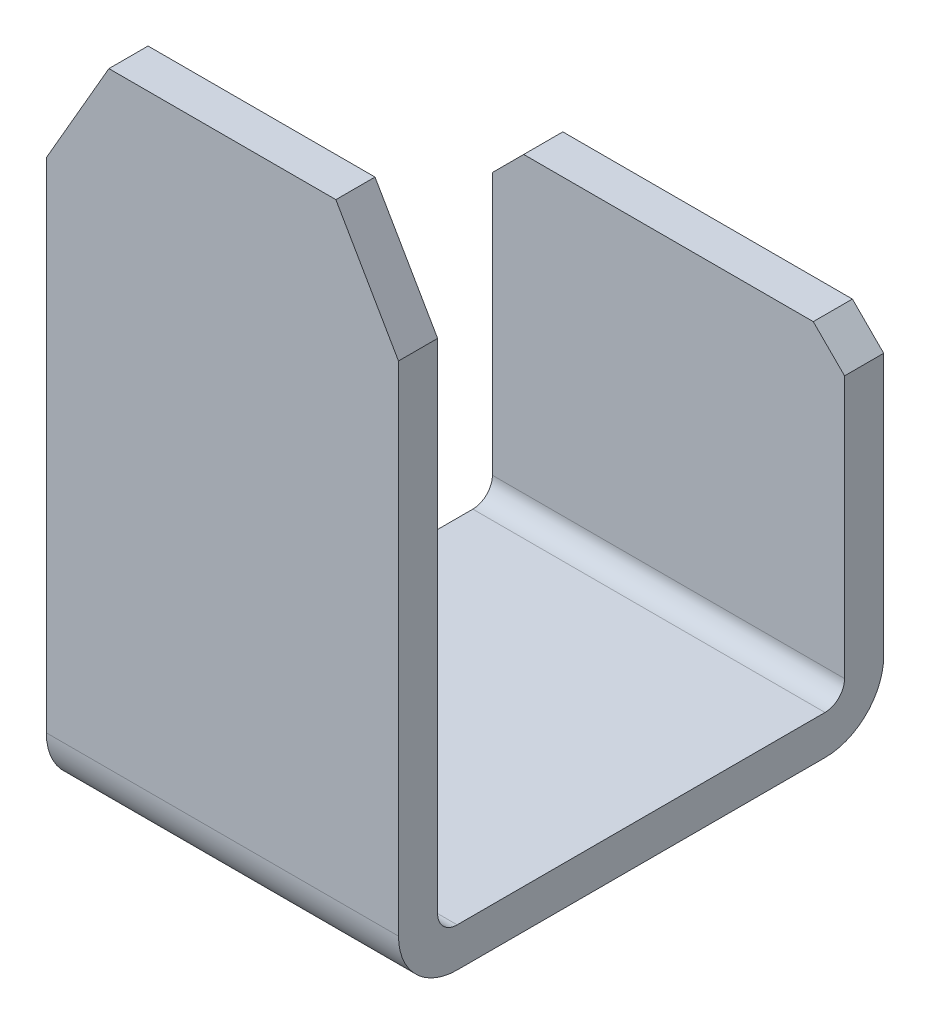
ISO-10303-21;
HEADER;
FILE_DESCRIPTION(('STEP AP214'),'2;1');
FILE_NAME('part.step','',(''),(''),'','','');
FILE_SCHEMA(('AUTOMOTIVE_DESIGN { 1 0 10303 214 1 1 1 1 }'));
ENDSEC;
DATA;
#1=APPLICATION_CONTEXT('core data for automotive mechanical design processes');
#2=APPLICATION_PROTOCOL_DEFINITION('international standard','automotive_design',2000,#1);
#3=PRODUCT_CONTEXT('',#1,'mechanical');
#4=PRODUCT('Part','Part','',(#3));
#5=PRODUCT_RELATED_PRODUCT_CATEGORY('part','',(#4));
#6=PRODUCT_DEFINITION_FORMATION('','',#4);
#7=PRODUCT_DEFINITION_CONTEXT('part definition',#1,'design');
#8=PRODUCT_DEFINITION('design','',#6,#7);
#9=PRODUCT_DEFINITION_SHAPE('','',#8);
#10=(LENGTH_UNIT() NAMED_UNIT(*) SI_UNIT(.MILLI.,.METRE.));
#11=(NAMED_UNIT(*) PLANE_ANGLE_UNIT() SI_UNIT($,.RADIAN.));
#12=(NAMED_UNIT(*) SI_UNIT($,.STERADIAN.) SOLID_ANGLE_UNIT());
#13=UNCERTAINTY_MEASURE_WITH_UNIT(LENGTH_MEASURE(1.E-05),#10,'distance_accuracy_value','');
#14=(GEOMETRIC_REPRESENTATION_CONTEXT(3) GLOBAL_UNCERTAINTY_ASSIGNED_CONTEXT((#13)) GLOBAL_UNIT_ASSIGNED_CONTEXT((#10,
#11,#12)) REPRESENTATION_CONTEXT('',''));
#15=CARTESIAN_POINT('',(0.,0.,0.));
#16=DIRECTION('',(0.,0.,1.));
#17=DIRECTION('',(1.,0.,0.));
#18=AXIS2_PLACEMENT_3D('',#15,#16,#17);
#19=CARTESIAN_POINT('',(14.2875,28.575,-19.685));
#20=DIRECTION('',(0.,0.,-1.));
#21=DIRECTION('',(0.,1.,0.));
#22=AXIS2_PLACEMENT_3D('',#19,#20,#21);
#23=PLANE('',#22);
#24=DIRECTION('',(0.,1.,0.));
#25=VECTOR('',#24,1.);
#26=CARTESIAN_POINT('',(14.2875,28.575,-19.685));
#27=LINE('',#26,#25);
#28=CARTESIAN_POINT('',(14.2875,4.76250000000002,-19.685));
#29=VERTEX_POINT('',#28);
#30=CARTESIAN_POINT('',(14.2875,26.035,-19.685));
#31=VERTEX_POINT('',#30);
#32=EDGE_CURVE('E199',#29,#31,#27,.T.);
#33=ORIENTED_EDGE('',*,*,#32,.F.);
#34=DIRECTION('',(1.,0.,0.));
#35=VECTOR('',#34,1.);
#36=CARTESIAN_POINT('',(14.2875,4.76250000000002,-19.685));
#37=LINE('',#36,#35);
#38=CARTESIAN_POINT('',(-14.2875,4.76250000000002,-19.685));
#39=VERTEX_POINT('',#38);
#40=EDGE_CURVE('E201',#39,#29,#37,.T.);
#41=ORIENTED_EDGE('',*,*,#40,.F.);
#42=DIRECTION('',(0.,1.,0.));
#43=VECTOR('',#42,1.);
#44=CARTESIAN_POINT('',(-14.2875,28.575,-19.685));
#45=LINE('',#44,#43);
#46=CARTESIAN_POINT('',(-14.2875,26.035,-19.685));
#47=VERTEX_POINT('',#46);
#48=EDGE_CURVE('E86',#39,#47,#45,.T.);
#49=ORIENTED_EDGE('',*,*,#48,.T.);
#50=DIRECTION('',(-0.707106781186548,-0.707106781186548,0.));
#51=VECTOR('',#50,1.);
#52=CARTESIAN_POINT('',(-11.7475,28.575,-19.685));
#53=LINE('',#52,#51);
#54=CARTESIAN_POINT('',(-11.7475,28.575,-19.685));
#55=VERTEX_POINT('',#54);
#56=EDGE_CURVE('E116',#55,#47,#53,.T.);
#57=ORIENTED_EDGE('',*,*,#56,.F.);
#58=DIRECTION('',(1.,0.,0.));
#59=VECTOR('',#58,1.);
#60=CARTESIAN_POINT('',(14.2875,28.575,-19.685));
#61=LINE('',#60,#59);
#62=CARTESIAN_POINT('',(11.7475,28.575,-19.685));
#63=VERTEX_POINT('',#62);
#64=EDGE_CURVE('E120',#55,#63,#61,.T.);
#65=ORIENTED_EDGE('',*,*,#64,.T.);
#66=DIRECTION('',(0.707106781186549,-0.707106781186547,0.));
#67=VECTOR('',#66,1.);
#68=CARTESIAN_POINT('',(14.2875,26.035,-19.685));
#69=LINE('',#68,#67);
#70=EDGE_CURVE('E144',#63,#31,#69,.T.);
#71=ORIENTED_EDGE('',*,*,#70,.T.);
#72=EDGE_LOOP('',(#33,#41,#49,#57,#65,#71));
#73=FACE_BOUND('',#72,.T.);
#74=ADVANCED_FACE('F17',(#73),#23,.T.);
#75=CARTESIAN_POINT('',(-11.7475,28.575,-16.51));
#76=DIRECTION('',(-0.707106781186548,0.707106781186548,0.));
#77=DIRECTION('',(-0.707106781186548,-0.707106781186548,0.));
#78=AXIS2_PLACEMENT_3D('',#75,#76,#77);
#79=PLANE('',#78);
#80=DIRECTION('',(0.,0.,-1.));
#81=VECTOR('',#80,1.);
#82=CARTESIAN_POINT('',(-14.2875,26.035,-16.51));
#83=LINE('',#82,#81);
#84=CARTESIAN_POINT('',(-14.2875,26.035,-16.51));
#85=VERTEX_POINT('',#84);
#86=EDGE_CURVE('E205',#47,#85,#83,.F.);
#87=ORIENTED_EDGE('',*,*,#86,.T.);
#88=DIRECTION('',(0.707106781186548,0.707106781186547,0.));
#89=VECTOR('',#88,1.);
#90=CARTESIAN_POINT('',(-14.2875,26.035,-16.51));
#91=LINE('',#90,#89);
#92=CARTESIAN_POINT('',(-11.7475,28.575,-16.51));
#93=VERTEX_POINT('',#92);
#94=EDGE_CURVE('E136',#85,#93,#91,.T.);
#95=ORIENTED_EDGE('',*,*,#94,.T.);
#96=DIRECTION('',(0.,0.,-1.));
#97=VECTOR('',#96,1.);
#98=CARTESIAN_POINT('',(-11.7475,28.575,-16.51));
#99=LINE('',#98,#97);
#100=EDGE_CURVE('E125',#93,#55,#99,.T.);
#101=ORIENTED_EDGE('',*,*,#100,.T.);
#102=ORIENTED_EDGE('',*,*,#56,.T.);
#103=EDGE_LOOP('',(#87,#95,#101,#102));
#104=FACE_BOUND('',#103,.T.);
#105=ADVANCED_FACE('F135',(#104),#79,.T.);
#106=CARTESIAN_POINT('',(14.2875,28.575,-16.51));
#107=DIRECTION('',(0.,-1.,0.));
#108=DIRECTION('',(0.,0.,-1.));
#109=AXIS2_PLACEMENT_3D('',#106,#107,#108);
#110=PLANE('',#109);
#111=ORIENTED_EDGE('',*,*,#64,.F.);
#112=ORIENTED_EDGE('',*,*,#100,.F.);
#113=DIRECTION('',(1.,0.,0.));
#114=VECTOR('',#113,1.);
#115=CARTESIAN_POINT('',(14.2875,28.575,-16.51));
#116=LINE('',#115,#114);
#117=CARTESIAN_POINT('',(11.7475,28.575,-16.51));
#118=VERTEX_POINT('',#117);
#119=EDGE_CURVE('E213',#93,#118,#116,.T.);
#120=ORIENTED_EDGE('',*,*,#119,.T.);
#121=DIRECTION('',(0.,0.,1.));
#122=VECTOR('',#121,1.);
#123=CARTESIAN_POINT('',(11.7475,28.575,-16.51));
#124=LINE('',#123,#122);
#125=EDGE_CURVE('E132',#118,#63,#124,.F.);
#126=ORIENTED_EDGE('',*,*,#125,.T.);
#127=EDGE_LOOP('',(#111,#112,#120,#126));
#128=FACE_BOUND('',#127,.T.);
#129=ADVANCED_FACE('F129',(#128),#110,.F.);
#130=CARTESIAN_POINT('',(14.2875,26.035,-16.51));
#131=DIRECTION('',(-0.707106781186547,-0.707106781186549,0.));
#132=DIRECTION('',(0.707106781186549,-0.707106781186547,0.));
#133=AXIS2_PLACEMENT_3D('',#130,#131,#132);
#134=PLANE('',#133);
#135=ORIENTED_EDGE('',*,*,#70,.F.);
#136=ORIENTED_EDGE('',*,*,#125,.F.);
#137=DIRECTION('',(0.707106781186549,-0.707106781186547,0.));
#138=VECTOR('',#137,1.);
#139=CARTESIAN_POINT('',(11.7475,28.575,-16.51));
#140=LINE('',#139,#138);
#141=CARTESIAN_POINT('',(14.2875,26.035,-16.51));
#142=VERTEX_POINT('',#141);
#143=EDGE_CURVE('E192',#118,#142,#140,.T.);
#144=ORIENTED_EDGE('',*,*,#143,.T.);
#145=DIRECTION('',(0.,0.,-1.));
#146=VECTOR('',#145,1.);
#147=CARTESIAN_POINT('',(14.2875,26.035,-16.51));
#148=LINE('',#147,#146);
#149=EDGE_CURVE('E93',#31,#142,#148,.F.);
#150=ORIENTED_EDGE('',*,*,#149,.F.);
#151=EDGE_LOOP('',(#135,#136,#144,#150));
#152=FACE_BOUND('',#151,.T.);
#153=ADVANCED_FACE('F229',(#152),#134,.F.);
#154=CARTESIAN_POINT('',(14.2875,4.76250000000002,-14.9225));
#155=DIRECTION('',(1.,0.,0.));
#156=DIRECTION('',(0.,0.,-1.));
#157=AXIS2_PLACEMENT_3D('',#154,#155,#156);
#158=CYLINDRICAL_SURFACE('',#157,4.7625);
#159=CARTESIAN_POINT('',(-14.2875,4.76250000000002,-14.9225));
#160=DIRECTION('',(1.,0.,0.));
#161=DIRECTION('',(0.,0.,-1.));
#162=AXIS2_PLACEMENT_3D('',#159,#160,#161);
#163=CIRCLE('',#162,4.7625);
#164=CARTESIAN_POINT('',(-14.2875,0.,-14.9225));
#165=VERTEX_POINT('',#164);
#166=EDGE_CURVE('E20',#39,#165,#163,.F.);
#167=ORIENTED_EDGE('',*,*,#166,.F.);
#168=ORIENTED_EDGE('',*,*,#40,.T.);
#169=CARTESIAN_POINT('',(14.2875,4.76250000000002,-14.9225));
#170=DIRECTION('',(1.,0.,0.));
#171=DIRECTION('',(0.,0.,-1.));
#172=AXIS2_PLACEMENT_3D('',#169,#170,#171);
#173=CIRCLE('',#172,4.7625);
#174=CARTESIAN_POINT('',(14.2875,0.,-14.9225));
#175=VERTEX_POINT('',#174);
#176=EDGE_CURVE('E174',#175,#29,#173,.T.);
#177=ORIENTED_EDGE('',*,*,#176,.F.);
#178=DIRECTION('',(1.,0.,0.));
#179=VECTOR('',#178,1.);
#180=CARTESIAN_POINT('',(14.2875,0.,-14.9225));
#181=LINE('',#180,#179);
#182=EDGE_CURVE('E176',#165,#175,#181,.T.);
#183=ORIENTED_EDGE('',*,*,#182,.F.);
#184=EDGE_LOOP('',(#167,#168,#177,#183));
#185=FACE_BOUND('',#184,.T.);
#186=ADVANCED_FACE('F287',(#185),#158,.T.);
#187=CARTESIAN_POINT('',(14.2875,28.575,-16.51));
#188=DIRECTION('',(0.,0.,-1.));
#189=DIRECTION('',(0.,1.,0.));
#190=AXIS2_PLACEMENT_3D('',#187,#188,#189);
#191=PLANE('',#190);
#192=DIRECTION('',(1.,0.,0.));
#193=VECTOR('',#192,1.);
#194=CARTESIAN_POINT('',(14.2875,4.76250000000002,-16.51));
#195=LINE('',#194,#193);
#196=CARTESIAN_POINT('',(-14.2875,4.76250000000002,-16.51));
#197=VERTEX_POINT('',#196);
#198=CARTESIAN_POINT('',(14.2875,4.76250000000002,-16.51));
#199=VERTEX_POINT('',#198);
#200=EDGE_CURVE('E171',#197,#199,#195,.T.);
#201=ORIENTED_EDGE('',*,*,#200,.T.);
#202=DIRECTION('',(0.,1.,0.));
#203=VECTOR('',#202,1.);
#204=CARTESIAN_POINT('',(14.2875,28.575,-16.51));
#205=LINE('',#204,#203);
#206=EDGE_CURVE('E190',#142,#199,#205,.F.);
#207=ORIENTED_EDGE('',*,*,#206,.F.);
#208=ORIENTED_EDGE('',*,*,#143,.F.);
#209=ORIENTED_EDGE('',*,*,#119,.F.);
#210=ORIENTED_EDGE('',*,*,#94,.F.);
#211=DIRECTION('',(0.,1.,0.));
#212=VECTOR('',#211,1.);
#213=CARTESIAN_POINT('',(-14.2875,28.575,-16.51));
#214=LINE('',#213,#212);
#215=EDGE_CURVE('E184',#197,#85,#214,.T.);
#216=ORIENTED_EDGE('',*,*,#215,.F.);
#217=EDGE_LOOP('',(#201,#207,#208,#209,#210,#216));
#218=FACE_BOUND('',#217,.T.);
#219=ADVANCED_FACE('F227',(#218),#191,.F.);
#220=CARTESIAN_POINT('',(14.2875,0.,-16.51));
#221=DIRECTION('',(0.,-1.,0.));
#222=DIRECTION('',(0.,0.,-1.));
#223=AXIS2_PLACEMENT_3D('',#220,#221,#222);
#224=PLANE('',#223);
#225=DIRECTION('',(0.,0.,-1.));
#226=VECTOR('',#225,1.);
#227=CARTESIAN_POINT('',(14.2875,0.,-16.51));
#228=LINE('',#227,#226);
#229=CARTESIAN_POINT('',(14.2875,0.,14.9225));
#230=VERTEX_POINT('',#229);
#231=EDGE_CURVE('E167',#230,#175,#228,.T.);
#232=ORIENTED_EDGE('',*,*,#231,.F.);
#233=DIRECTION('',(1.,0.,0.));
#234=VECTOR('',#233,1.);
#235=CARTESIAN_POINT('',(14.2875,0.,14.9225));
#236=LINE('',#235,#234);
#237=CARTESIAN_POINT('',(-14.2875,0.,14.9225));
#238=VERTEX_POINT('',#237);
#239=EDGE_CURVE('E413',#238,#230,#236,.T.);
#240=ORIENTED_EDGE('',*,*,#239,.F.);
#241=DIRECTION('',(0.,0.,-1.));
#242=VECTOR('',#241,1.);
#243=CARTESIAN_POINT('',(-14.2875,0.,-16.51));
#244=LINE('',#243,#242);
#245=EDGE_CURVE('E170',#238,#165,#244,.T.);
#246=ORIENTED_EDGE('',*,*,#245,.T.);
#247=ORIENTED_EDGE('',*,*,#182,.T.);
#248=EDGE_LOOP('',(#232,#240,#246,#247));
#249=FACE_BOUND('',#248,.T.);
#250=ADVANCED_FACE('F281',(#249),#224,.T.);
#251=CARTESIAN_POINT('',(14.2875,4.76250000000002,-14.9225));
#252=DIRECTION('',(1.,0.,0.));
#253=DIRECTION('',(0.,0.,-1.));
#254=AXIS2_PLACEMENT_3D('',#251,#252,#253);
#255=CYLINDRICAL_SURFACE('',#254,1.5875);
#256=ORIENTED_EDGE('',*,*,#200,.F.);
#257=CARTESIAN_POINT('',(-14.2875,4.76250000000002,-14.9225));
#258=DIRECTION('',(1.,0.,0.));
#259=DIRECTION('',(0.,0.,-1.));
#260=AXIS2_PLACEMENT_3D('',#257,#258,#259);
#261=CIRCLE('',#260,1.5875);
#262=CARTESIAN_POINT('',(-14.2875,3.17500000000002,-14.9225));
#263=VERTEX_POINT('',#262);
#264=EDGE_CURVE('E172',#263,#197,#261,.T.);
#265=ORIENTED_EDGE('',*,*,#264,.F.);
#266=DIRECTION('',(1.,0.,0.));
#267=VECTOR('',#266,1.);
#268=CARTESIAN_POINT('',(14.2875,3.17500000000002,-14.9225));
#269=LINE('',#268,#267);
#270=CARTESIAN_POINT('',(14.2875,3.17500000000002,-14.9225));
#271=VERTEX_POINT('',#270);
#272=EDGE_CURVE('E166',#263,#271,#269,.T.);
#273=ORIENTED_EDGE('',*,*,#272,.T.);
#274=CARTESIAN_POINT('',(14.2875,4.76250000000002,-14.9225));
#275=DIRECTION('',(1.,0.,0.));
#276=DIRECTION('',(0.,0.,-1.));
#277=AXIS2_PLACEMENT_3D('',#274,#275,#276);
#278=CIRCLE('',#277,1.5875);
#279=EDGE_CURVE('E168',#199,#271,#278,.F.);
#280=ORIENTED_EDGE('',*,*,#279,.F.);
#281=EDGE_LOOP('',(#256,#265,#273,#280));
#282=FACE_BOUND('',#281,.T.);
#283=ADVANCED_FACE('F277',(#282),#255,.F.);
#284=CARTESIAN_POINT('',(14.2875,4.7625,14.9225));
#285=DIRECTION('',(1.,0.,0.));
#286=DIRECTION('',(0.,0.,-1.));
#287=AXIS2_PLACEMENT_3D('',#284,#285,#286);
#288=CYLINDRICAL_SURFACE('',#287,4.7625);
#289=CARTESIAN_POINT('',(-14.2875,4.7625,14.9225));
#290=DIRECTION('',(1.,0.,0.));
#291=DIRECTION('',(0.,0.,-1.));
#292=AXIS2_PLACEMENT_3D('',#289,#290,#291);
#293=CIRCLE('',#292,4.7625);
#294=CARTESIAN_POINT('',(-14.2875,4.7625,19.685));
#295=VERTEX_POINT('',#294);
#296=EDGE_CURVE('E164',#238,#295,#293,.F.);
#297=ORIENTED_EDGE('',*,*,#296,.F.);
#298=ORIENTED_EDGE('',*,*,#239,.T.);
#299=CARTESIAN_POINT('',(14.2875,4.7625,14.9225));
#300=DIRECTION('',(1.,0.,0.));
#301=DIRECTION('',(0.,0.,-1.));
#302=AXIS2_PLACEMENT_3D('',#299,#300,#301);
#303=CIRCLE('',#302,4.7625);
#304=CARTESIAN_POINT('',(14.2875,4.7625,19.685));
#305=VERTEX_POINT('',#304);
#306=EDGE_CURVE('E159',#305,#230,#303,.T.);
#307=ORIENTED_EDGE('',*,*,#306,.F.);
#308=DIRECTION('',(1.,0.,0.));
#309=VECTOR('',#308,1.);
#310=CARTESIAN_POINT('',(14.2875,4.7625,19.685));
#311=LINE('',#310,#309);
#312=EDGE_CURVE('E163',#295,#305,#311,.T.);
#313=ORIENTED_EDGE('',*,*,#312,.F.);
#314=EDGE_LOOP('',(#297,#298,#307,#313));
#315=FACE_BOUND('',#314,.T.);
#316=ADVANCED_FACE('F273',(#315),#288,.T.);
#317=CARTESIAN_POINT('',(14.2875,3.17500000000002,-16.51));
#318=DIRECTION('',(0.,-1.,0.));
#319=DIRECTION('',(0.,0.,-1.));
#320=AXIS2_PLACEMENT_3D('',#317,#318,#319);
#321=PLANE('',#320);
#322=DIRECTION('',(1.,0.,0.));
#323=VECTOR('',#322,1.);
#324=CARTESIAN_POINT('',(14.2875,3.175,14.9225));
#325=LINE('',#324,#323);
#326=CARTESIAN_POINT('',(-14.2875,3.175,14.9225));
#327=VERTEX_POINT('',#326);
#328=CARTESIAN_POINT('',(14.2875,3.175,14.9225));
#329=VERTEX_POINT('',#328);
#330=EDGE_CURVE('E154',#327,#329,#325,.T.);
#331=ORIENTED_EDGE('',*,*,#330,.T.);
#332=DIRECTION('',(0.,0.,-1.));
#333=VECTOR('',#332,1.);
#334=CARTESIAN_POINT('',(14.2875,3.17500000000002,-16.51));
#335=LINE('',#334,#333);
#336=EDGE_CURVE('E461',#271,#329,#335,.F.);
#337=ORIENTED_EDGE('',*,*,#336,.F.);
#338=ORIENTED_EDGE('',*,*,#272,.F.);
#339=DIRECTION('',(0.,0.,-1.));
#340=VECTOR('',#339,1.);
#341=CARTESIAN_POINT('',(-14.2875,3.17500000000002,-16.51));
#342=LINE('',#341,#340);
#343=EDGE_CURVE('E416',#327,#263,#342,.T.);
#344=ORIENTED_EDGE('',*,*,#343,.F.);
#345=EDGE_LOOP('',(#331,#337,#338,#344));
#346=FACE_BOUND('',#345,.T.);
#347=ADVANCED_FACE('F269',(#346),#321,.F.);
#348=CARTESIAN_POINT('',(14.2875,3.175,19.685));
#349=DIRECTION('',(0.,0.,1.));
#350=DIRECTION('',(0.,-1.,0.));
#351=AXIS2_PLACEMENT_3D('',#348,#349,#350);
#352=PLANE('',#351);
#353=DIRECTION('',(0.,1.,0.));
#354=VECTOR('',#353,1.);
#355=CARTESIAN_POINT('',(-14.2875,3.175,19.685));
#356=LINE('',#355,#354);
#357=CARTESIAN_POINT('',(-14.2875,45.1761818975501,19.685));
#358=VERTEX_POINT('',#357);
#359=EDGE_CURVE('E158',#358,#295,#356,.F.);
#360=ORIENTED_EDGE('',*,*,#359,.T.);
#361=ORIENTED_EDGE('',*,*,#312,.T.);
#362=DIRECTION('',(0.,1.,0.));
#363=VECTOR('',#362,1.);
#364=CARTESIAN_POINT('',(14.2875,3.175,19.685));
#365=LINE('',#364,#363);
#366=CARTESIAN_POINT('',(14.2875,45.1761818975501,19.685));
#367=VERTEX_POINT('',#366);
#368=EDGE_CURVE('E235',#367,#305,#365,.F.);
#369=ORIENTED_EDGE('',*,*,#368,.F.);
#370=DIRECTION('',(0.500000000000002,-0.866025403784437,0.));
#371=VECTOR('',#370,1.);
#372=CARTESIAN_POINT('',(14.2875,45.1761818975501,19.685));
#373=LINE('',#372,#371);
#374=CARTESIAN_POINT('',(9.20749999999998,53.975,19.685));
#375=VERTEX_POINT('',#374);
#376=EDGE_CURVE('E162',#367,#375,#373,.F.);
#377=ORIENTED_EDGE('',*,*,#376,.T.);
#378=DIRECTION('',(1.,0.,0.));
#379=VECTOR('',#378,1.);
#380=CARTESIAN_POINT('',(14.2875,53.975,19.685));
#381=LINE('',#380,#379);
#382=CARTESIAN_POINT('',(-9.20749999999998,53.975,19.685));
#383=VERTEX_POINT('',#382);
#384=EDGE_CURVE('E447',#383,#375,#381,.T.);
#385=ORIENTED_EDGE('',*,*,#384,.F.);
#386=DIRECTION('',(-0.500000000000002,-0.866025403784437,0.));
#387=VECTOR('',#386,1.);
#388=CARTESIAN_POINT('',(-9.20749999999998,53.975,19.685));
#389=LINE('',#388,#387);
#390=EDGE_CURVE('E421',#358,#383,#389,.F.);
#391=ORIENTED_EDGE('',*,*,#390,.F.);
#392=EDGE_LOOP('',(#360,#361,#369,#377,#385,#391));
#393=FACE_BOUND('',#392,.T.);
#394=ADVANCED_FACE('F265',(#393),#352,.T.);
#395=CARTESIAN_POINT('',(14.2875,45.1761818975501,16.51));
#396=DIRECTION('',(-0.866025403784437,-0.500000000000002,0.));
#397=DIRECTION('',(0.500000000000002,-0.866025403784437,0.));
#398=AXIS2_PLACEMENT_3D('',#395,#396,#397);
#399=PLANE('',#398);
#400=ORIENTED_EDGE('',*,*,#376,.F.);
#401=DIRECTION('',(0.,0.,-1.));
#402=VECTOR('',#401,1.);
#403=CARTESIAN_POINT('',(14.2875,45.1761818975501,16.51));
#404=LINE('',#403,#402);
#405=CARTESIAN_POINT('',(14.2875,45.1761818975501,16.51));
#406=VERTEX_POINT('',#405);
#407=EDGE_CURVE('E153',#406,#367,#404,.F.);
#408=ORIENTED_EDGE('',*,*,#407,.F.);
#409=DIRECTION('',(-0.500000000000002,0.866025403784438,0.));
#410=VECTOR('',#409,1.);
#411=CARTESIAN_POINT('',(14.2875,45.1761818975501,16.51));
#412=LINE('',#411,#410);
#413=CARTESIAN_POINT('',(9.20749999999998,53.975,16.51));
#414=VERTEX_POINT('',#413);
#415=EDGE_CURVE('E485',#406,#414,#412,.T.);
#416=ORIENTED_EDGE('',*,*,#415,.T.);
#417=DIRECTION('',(0.,0.,1.));
#418=VECTOR('',#417,1.);
#419=CARTESIAN_POINT('',(9.20749999999998,53.975,16.51));
#420=LINE('',#419,#418);
#421=EDGE_CURVE('E437',#375,#414,#420,.F.);
#422=ORIENTED_EDGE('',*,*,#421,.F.);
#423=EDGE_LOOP('',(#400,#408,#416,#422));
#424=FACE_BOUND('',#423,.T.);
#425=ADVANCED_FACE('F261',(#424),#399,.F.);
#426=CARTESIAN_POINT('',(14.2875,53.975,16.51));
#427=DIRECTION('',(0.,1.,0.));
#428=DIRECTION('',(0.,0.,1.));
#429=AXIS2_PLACEMENT_3D('',#426,#427,#428);
#430=PLANE('',#429);
#431=ORIENTED_EDGE('',*,*,#421,.T.);
#432=DIRECTION('',(1.,0.,0.));
#433=VECTOR('',#432,1.);
#434=CARTESIAN_POINT('',(14.2875,53.975,16.51));
#435=LINE('',#434,#433);
#436=CARTESIAN_POINT('',(-9.20749999999998,53.975,16.51));
#437=VERTEX_POINT('',#436);
#438=EDGE_CURVE('E444',#414,#437,#435,.F.);
#439=ORIENTED_EDGE('',*,*,#438,.T.);
#440=DIRECTION('',(0.,0.,1.));
#441=VECTOR('',#440,1.);
#442=CARTESIAN_POINT('',(-9.20749999999998,53.975,16.51));
#443=LINE('',#442,#441);
#444=EDGE_CURVE('E426',#383,#437,#443,.F.);
#445=ORIENTED_EDGE('',*,*,#444,.F.);
#446=ORIENTED_EDGE('',*,*,#384,.T.);
#447=EDGE_LOOP('',(#431,#439,#445,#446));
#448=FACE_BOUND('',#447,.T.);
#449=ADVANCED_FACE('F257',(#448),#430,.T.);
#450=CARTESIAN_POINT('',(-9.20749999999998,53.975,16.51));
#451=DIRECTION('',(-0.866025403784437,0.500000000000002,0.));
#452=DIRECTION('',(-0.500000000000002,-0.866025403784437,0.));
#453=AXIS2_PLACEMENT_3D('',#450,#451,#452);
#454=PLANE('',#453);
#455=ORIENTED_EDGE('',*,*,#444,.T.);
#456=DIRECTION('',(-0.500000000000002,-0.866025403784437,0.));
#457=VECTOR('',#456,1.);
#458=CARTESIAN_POINT('',(-9.20749999999998,53.975,16.51));
#459=LINE('',#458,#457);
#460=CARTESIAN_POINT('',(-14.2875,45.1761818975501,16.51));
#461=VERTEX_POINT('',#460);
#462=EDGE_CURVE('E440',#437,#461,#459,.T.);
#463=ORIENTED_EDGE('',*,*,#462,.T.);
#464=DIRECTION('',(0.,0.,-1.));
#465=VECTOR('',#464,1.);
#466=CARTESIAN_POINT('',(-14.2875,45.1761818975501,16.51));
#467=LINE('',#466,#465);
#468=EDGE_CURVE('E424',#461,#358,#467,.F.);
#469=ORIENTED_EDGE('',*,*,#468,.T.);
#470=ORIENTED_EDGE('',*,*,#390,.T.);
#471=EDGE_LOOP('',(#455,#463,#469,#470));
#472=FACE_BOUND('',#471,.T.);
#473=ADVANCED_FACE('F254',(#472),#454,.T.);
#474=CARTESIAN_POINT('',(-14.2875,3.175,16.51));
#475=DIRECTION('',(1.,0.,0.));
#476=DIRECTION('',(0.,0.,-1.));
#477=AXIS2_PLACEMENT_3D('',#474,#475,#476);
#478=PLANE('',#477);
#479=ORIENTED_EDGE('',*,*,#359,.F.);
#480=ORIENTED_EDGE('',*,*,#468,.F.);
#481=DIRECTION('',(0.,-1.,0.));
#482=VECTOR('',#481,1.);
#483=CARTESIAN_POINT('',(-14.2875,3.175,16.51));
#484=LINE('',#483,#482);
#485=CARTESIAN_POINT('',(-14.2875,4.7625,16.51));
#486=VERTEX_POINT('',#485);
#487=EDGE_CURVE('E443',#461,#486,#484,.T.);
#488=ORIENTED_EDGE('',*,*,#487,.T.);
#489=CARTESIAN_POINT('',(-14.2875,4.7625,14.9225));
#490=DIRECTION('',(1.,0.,0.));
#491=DIRECTION('',(0.,0.,-1.));
#492=AXIS2_PLACEMENT_3D('',#489,#490,#491);
#493=CIRCLE('',#492,1.5875);
#494=EDGE_CURVE('E155',#486,#327,#493,.T.);
#495=ORIENTED_EDGE('',*,*,#494,.T.);
#496=ORIENTED_EDGE('',*,*,#343,.T.);
#497=ORIENTED_EDGE('',*,*,#264,.T.);
#498=ORIENTED_EDGE('',*,*,#215,.T.);
#499=ORIENTED_EDGE('',*,*,#86,.F.);
#500=ORIENTED_EDGE('',*,*,#48,.F.);
#501=ORIENTED_EDGE('',*,*,#166,.T.);
#502=ORIENTED_EDGE('',*,*,#245,.F.);
#503=ORIENTED_EDGE('',*,*,#296,.T.);
#504=EDGE_LOOP('',(#479,#480,#488,#495,#496,#497,#498,#499,#500,#501,#502,#503));
#505=FACE_BOUND('',#504,.T.);
#506=ADVANCED_FACE('F248',(#505),#478,.F.);
#507=CARTESIAN_POINT('',(14.2875,4.7625,14.9225));
#508=DIRECTION('',(1.,0.,0.));
#509=DIRECTION('',(0.,0.,-1.));
#510=AXIS2_PLACEMENT_3D('',#507,#508,#509);
#511=CYLINDRICAL_SURFACE('',#510,1.5875);
#512=ORIENTED_EDGE('',*,*,#330,.F.);
#513=ORIENTED_EDGE('',*,*,#494,.F.);
#514=DIRECTION('',(1.,0.,0.));
#515=VECTOR('',#514,1.);
#516=CARTESIAN_POINT('',(14.2875,4.7625,16.51));
#517=LINE('',#516,#515);
#518=CARTESIAN_POINT('',(14.2875,4.7625,16.51));
#519=VERTEX_POINT('',#518);
#520=EDGE_CURVE('E26',#486,#519,#517,.T.);
#521=ORIENTED_EDGE('',*,*,#520,.T.);
#522=CARTESIAN_POINT('',(14.2875,4.7625,14.9225));
#523=DIRECTION('',(1.,0.,0.));
#524=DIRECTION('',(0.,0.,-1.));
#525=AXIS2_PLACEMENT_3D('',#522,#523,#524);
#526=CIRCLE('',#525,1.5875);
#527=EDGE_CURVE('E34',#329,#519,#526,.F.);
#528=ORIENTED_EDGE('',*,*,#527,.F.);
#529=EDGE_LOOP('',(#512,#513,#521,#528));
#530=FACE_BOUND('',#529,.T.);
#531=ADVANCED_FACE('F239',(#530),#511,.F.);
#532=CARTESIAN_POINT('',(14.2875,3.175,16.51));
#533=DIRECTION('',(1.,0.,0.));
#534=DIRECTION('',(0.,0.,-1.));
#535=AXIS2_PLACEMENT_3D('',#532,#533,#534);
#536=PLANE('',#535);
#537=ORIENTED_EDGE('',*,*,#368,.T.);
#538=ORIENTED_EDGE('',*,*,#306,.T.);
#539=ORIENTED_EDGE('',*,*,#231,.T.);
#540=ORIENTED_EDGE('',*,*,#176,.T.);
#541=ORIENTED_EDGE('',*,*,#32,.T.);
#542=ORIENTED_EDGE('',*,*,#149,.T.);
#543=ORIENTED_EDGE('',*,*,#206,.T.);
#544=ORIENTED_EDGE('',*,*,#279,.T.);
#545=ORIENTED_EDGE('',*,*,#336,.T.);
#546=ORIENTED_EDGE('',*,*,#527,.T.);
#547=DIRECTION('',(0.,-1.,0.));
#548=VECTOR('',#547,1.);
#549=CARTESIAN_POINT('',(14.2875,3.175,16.51));
#550=LINE('',#549,#548);
#551=EDGE_CURVE('E11',#519,#406,#550,.F.);
#552=ORIENTED_EDGE('',*,*,#551,.T.);
#553=ORIENTED_EDGE('',*,*,#407,.T.);
#554=EDGE_LOOP('',(#537,#538,#539,#540,#541,#542,#543,#544,#545,#546,#552,#553));
#555=FACE_BOUND('',#554,.T.);
#556=ADVANCED_FACE('F232',(#555),#536,.T.);
#557=CARTESIAN_POINT('',(14.2875,3.175,16.51));
#558=DIRECTION('',(0.,0.,1.));
#559=DIRECTION('',(0.,-1.,0.));
#560=AXIS2_PLACEMENT_3D('',#557,#558,#559);
#561=PLANE('',#560);
#562=ORIENTED_EDGE('',*,*,#520,.F.);
#563=ORIENTED_EDGE('',*,*,#487,.F.);
#564=ORIENTED_EDGE('',*,*,#462,.F.);
#565=ORIENTED_EDGE('',*,*,#438,.F.);
#566=ORIENTED_EDGE('',*,*,#415,.F.);
#567=ORIENTED_EDGE('',*,*,#551,.F.);
#568=EDGE_LOOP('',(#562,#563,#564,#565,#566,#567));
#569=FACE_BOUND('',#568,.T.);
#570=ADVANCED_FACE('F238',(#569),#561,.F.);
#571=CLOSED_SHELL('',(#74,#105,#129,#153,#186,#219,#250,#283,#316,#347,#394,#425,#449,#473,#506,
#531,#556,#570));
#572=MANIFOLD_SOLID_BREP('B1',#571);
#573=ADVANCED_BREP_SHAPE_REPRESENTATION('',(#18,#572),#14);
#574=SHAPE_DEFINITION_REPRESENTATION(#9,#573);
ENDSEC;
END-ISO-10303-21;
